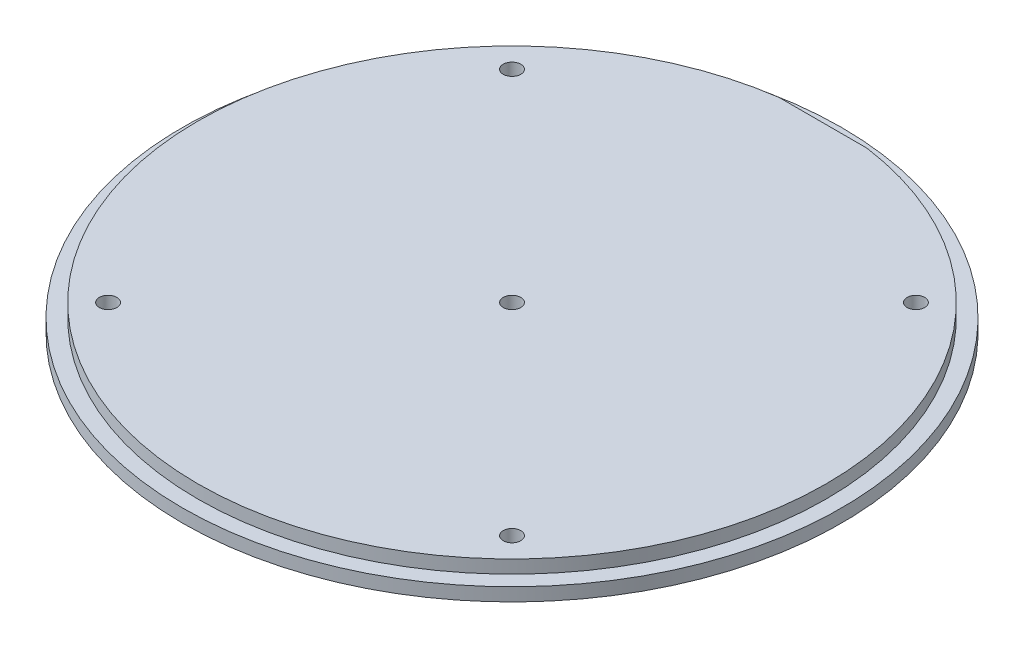
ISO-10303-21;
HEADER;
FILE_DESCRIPTION(('STEP AP214'),'2;1');
FILE_NAME('part.step','',(''),(''),'','','');
FILE_SCHEMA(('AUTOMOTIVE_DESIGN { 1 0 10303 214 1 1 1 1 }'));
ENDSEC;
DATA;
#1=APPLICATION_CONTEXT('core data for automotive mechanical design processes');
#2=APPLICATION_PROTOCOL_DEFINITION('international standard','automotive_design',2000,#1);
#3=PRODUCT_CONTEXT('',#1,'mechanical');
#4=PRODUCT('Part','Part','',(#3));
#5=PRODUCT_RELATED_PRODUCT_CATEGORY('part','',(#4));
#6=PRODUCT_DEFINITION_FORMATION('','',#4);
#7=PRODUCT_DEFINITION_CONTEXT('part definition',#1,'design');
#8=PRODUCT_DEFINITION('design','',#6,#7);
#9=PRODUCT_DEFINITION_SHAPE('','',#8);
#10=(LENGTH_UNIT() NAMED_UNIT(*) SI_UNIT(.MILLI.,.METRE.));
#11=(NAMED_UNIT(*) PLANE_ANGLE_UNIT() SI_UNIT($,.RADIAN.));
#12=(NAMED_UNIT(*) SI_UNIT($,.STERADIAN.) SOLID_ANGLE_UNIT());
#13=UNCERTAINTY_MEASURE_WITH_UNIT(LENGTH_MEASURE(1.E-05),#10,'distance_accuracy_value','');
#14=(GEOMETRIC_REPRESENTATION_CONTEXT(3) GLOBAL_UNCERTAINTY_ASSIGNED_CONTEXT((#13)) GLOBAL_UNIT_ASSIGNED_CONTEXT((#10,
#11,#12)) REPRESENTATION_CONTEXT('',''));
#15=CARTESIAN_POINT('',(0.,0.,0.));
#16=DIRECTION('',(0.,0.,1.));
#17=DIRECTION('',(1.,0.,0.));
#18=AXIS2_PLACEMENT_3D('',#15,#16,#17);
#19=CARTESIAN_POINT('',(0.,3.,0.));
#20=DIRECTION('',(0.,-1.,0.));
#21=DIRECTION('',(0.,0.,-1.));
#22=AXIS2_PLACEMENT_3D('',#19,#20,#21);
#23=CYLINDRICAL_SURFACE('',#22,75.);
#24=CARTESIAN_POINT('',(0.,3.,0.));
#25=DIRECTION('',(0.,1.,0.));
#26=DIRECTION('',(0.,0.,1.));
#27=AXIS2_PLACEMENT_3D('',#24,#25,#26);
#28=CIRCLE('',#27,75.);
#29=CARTESIAN_POINT('',(0.,3.,75.));
#30=VERTEX_POINT('',#29);
#31=EDGE_CURVE('E80',#30,#30,#28,.T.);
#32=ORIENTED_EDGE('',*,*,#31,.F.);
#33=EDGE_LOOP('',(#32));
#34=FACE_BOUND('',#33,.T.);
#35=CARTESIAN_POINT('',(0.,0.,0.));
#36=DIRECTION('',(0.,1.,0.));
#37=DIRECTION('',(0.,0.,1.));
#38=AXIS2_PLACEMENT_3D('',#35,#36,#37);
#39=CIRCLE('',#38,75.);
#40=CARTESIAN_POINT('',(0.,0.,75.));
#41=VERTEX_POINT('',#40);
#42=EDGE_CURVE('E76',#41,#41,#39,.T.);
#43=ORIENTED_EDGE('',*,*,#42,.T.);
#44=EDGE_LOOP('',(#43));
#45=FACE_BOUND('',#44,.T.);
#46=ADVANCED_FACE('F35',(#34,#45),#23,.T.);
#47=CARTESIAN_POINT('',(0.,3.,0.));
#48=DIRECTION('',(0.,1.,0.));
#49=DIRECTION('',(0.,0.,1.));
#50=AXIS2_PLACEMENT_3D('',#47,#48,#49);
#51=PLANE('',#50);
#52=CARTESIAN_POINT('',(0.,3.,0.));
#53=DIRECTION('',(0.,1.,0.));
#54=DIRECTION('',(0.,0.,1.));
#55=AXIS2_PLACEMENT_3D('',#52,#53,#54);
#56=CIRCLE('',#55,71.5);
#57=CARTESIAN_POINT('',(-10.,3.,-70.7972457091376));
#58=VERTEX_POINT('',#57);
#59=CARTESIAN_POINT('',(10.,3.,-70.7972457091376));
#60=VERTEX_POINT('',#59);
#61=EDGE_CURVE('E72',#58,#60,#56,.T.);
#62=ORIENTED_EDGE('',*,*,#61,.F.);
#63=DIRECTION('',(-1.,0.,0.));
#64=VECTOR('',#63,1.);
#65=CARTESIAN_POINT('',(-10.,3.,-70.7972457091376));
#66=LINE('',#65,#64);
#67=EDGE_CURVE('E55',#60,#58,#66,.T.);
#68=ORIENTED_EDGE('',*,*,#67,.F.);
#69=EDGE_LOOP('',(#62,#68));
#70=FACE_BOUND('',#69,.T.);
#71=ORIENTED_EDGE('',*,*,#31,.T.);
#72=EDGE_LOOP('',(#71));
#73=FACE_BOUND('',#72,.T.);
#74=ADVANCED_FACE('F130',(#70,#73),#51,.T.);
#75=CARTESIAN_POINT('',(0.,0.,0.));
#76=DIRECTION('',(0.,1.,0.));
#77=DIRECTION('',(0.,0.,1.));
#78=AXIS2_PLACEMENT_3D('',#75,#76,#77);
#79=PLANE('',#78);
#80=CARTESIAN_POINT('',(0.,0.,0.));
#81=DIRECTION('',(0.,1.,0.));
#82=DIRECTION('',(0.,0.,1.));
#83=AXIS2_PLACEMENT_3D('',#80,#81,#82);
#84=CIRCLE('',#83,4.);
#85=CARTESIAN_POINT('',(0.,0.,4.));
#86=VERTEX_POINT('',#85);
#87=EDGE_CURVE('E11',#86,#86,#84,.T.);
#88=ORIENTED_EDGE('',*,*,#87,.T.);
#89=EDGE_LOOP('',(#88));
#90=FACE_BOUND('',#89,.T.);
#91=CARTESIAN_POINT('',(45.9619407771258,0.,-45.9619407771253));
#92=DIRECTION('',(0.,1.,0.));
#93=DIRECTION('',(0.,0.,1.));
#94=AXIS2_PLACEMENT_3D('',#91,#92,#93);
#95=CIRCLE('',#94,4.00000000000006);
#96=CARTESIAN_POINT('',(45.9619407771258,0.,-41.9619407771253));
#97=VERTEX_POINT('',#96);
#98=EDGE_CURVE('E111',#97,#97,#95,.T.);
#99=ORIENTED_EDGE('',*,*,#98,.T.);
#100=EDGE_LOOP('',(#99));
#101=FACE_BOUND('',#100,.T.);
#102=CARTESIAN_POINT('',(-45.9619407771258,0.,-45.9619407771253));
#103=DIRECTION('',(0.,1.,0.));
#104=DIRECTION('',(0.,0.,1.));
#105=AXIS2_PLACEMENT_3D('',#102,#103,#104);
#106=CIRCLE('',#105,4.00000000000006);
#107=CARTESIAN_POINT('',(-45.9619407771258,0.,-41.9619407771253));
#108=VERTEX_POINT('',#107);
#109=EDGE_CURVE('E105',#108,#108,#106,.T.);
#110=ORIENTED_EDGE('',*,*,#109,.T.);
#111=EDGE_LOOP('',(#110));
#112=FACE_BOUND('',#111,.T.);
#113=CARTESIAN_POINT('',(-45.9619407771255,0.,45.9619407771257));
#114=DIRECTION('',(0.,1.,0.));
#115=DIRECTION('',(0.,0.,1.));
#116=AXIS2_PLACEMENT_3D('',#113,#114,#115);
#117=CIRCLE('',#116,4.);
#118=CARTESIAN_POINT('',(-45.9619407771255,0.,49.9619407771257));
#119=VERTEX_POINT('',#118);
#120=EDGE_CURVE('E99',#119,#119,#117,.T.);
#121=ORIENTED_EDGE('',*,*,#120,.T.);
#122=EDGE_LOOP('',(#121));
#123=FACE_BOUND('',#122,.T.);
#124=CARTESIAN_POINT('',(45.9619407771258,0.,45.9619407771253));
#125=DIRECTION('',(0.,1.,0.));
#126=DIRECTION('',(0.,0.,1.));
#127=AXIS2_PLACEMENT_3D('',#124,#125,#126);
#128=CIRCLE('',#127,4.00000000000006);
#129=CARTESIAN_POINT('',(45.9619407771258,0.,49.9619407771254));
#130=VERTEX_POINT('',#129);
#131=EDGE_CURVE('E93',#130,#130,#128,.T.);
#132=ORIENTED_EDGE('',*,*,#131,.T.);
#133=EDGE_LOOP('',(#132));
#134=FACE_BOUND('',#133,.T.);
#135=ORIENTED_EDGE('',*,*,#42,.F.);
#136=EDGE_LOOP('',(#135));
#137=FACE_BOUND('',#136,.T.);
#138=ADVANCED_FACE('F136',(#90,#101,#112,#123,#134,#137),#79,.F.);
#139=CARTESIAN_POINT('',(0.,6.,0.));
#140=DIRECTION('',(0.,-1.,0.));
#141=DIRECTION('',(0.,0.,-1.));
#142=AXIS2_PLACEMENT_3D('',#139,#140,#141);
#143=CYLINDRICAL_SURFACE('',#142,71.5);
#144=CARTESIAN_POINT('',(0.,6.,0.));
#145=DIRECTION('',(0.,1.,0.));
#146=DIRECTION('',(0.,0.,1.));
#147=AXIS2_PLACEMENT_3D('',#144,#145,#146);
#148=CIRCLE('',#147,71.5);
#149=CARTESIAN_POINT('',(-10.,6.,-70.7972457091376));
#150=VERTEX_POINT('',#149);
#151=CARTESIAN_POINT('',(10.,6.,-70.7972457091376));
#152=VERTEX_POINT('',#151);
#153=EDGE_CURVE('E70',#150,#152,#148,.T.);
#154=ORIENTED_EDGE('',*,*,#153,.F.);
#155=DIRECTION('',(0.,1.,0.));
#156=VECTOR('',#155,1.);
#157=CARTESIAN_POINT('',(-10.,-17.0123427812269,-70.7972457091376));
#158=LINE('',#157,#156);
#159=EDGE_CURVE('E50',#58,#150,#158,.T.);
#160=ORIENTED_EDGE('',*,*,#159,.F.);
#161=ORIENTED_EDGE('',*,*,#61,.T.);
#162=DIRECTION('',(0.,1.,0.));
#163=VECTOR('',#162,1.);
#164=CARTESIAN_POINT('',(10.,-17.0123427812269,-70.7972457091376));
#165=LINE('',#164,#163);
#166=EDGE_CURVE('E62',#60,#152,#165,.T.);
#167=ORIENTED_EDGE('',*,*,#166,.T.);
#168=EDGE_LOOP('',(#154,#160,#161,#167));
#169=FACE_BOUND('',#168,.T.);
#170=ADVANCED_FACE('F69',(#169),#143,.T.);
#171=CARTESIAN_POINT('',(0.,6.,0.));
#172=DIRECTION('',(0.,1.,0.));
#173=DIRECTION('',(0.,0.,1.));
#174=AXIS2_PLACEMENT_3D('',#171,#172,#173);
#175=PLANE('',#174);
#176=DIRECTION('',(1.,0.,0.));
#177=VECTOR('',#176,1.);
#178=CARTESIAN_POINT('',(-10.,6.,-70.7972457091376));
#179=LINE('',#178,#177);
#180=EDGE_CURVE('E59',#150,#152,#179,.T.);
#181=ORIENTED_EDGE('',*,*,#180,.F.);
#182=ORIENTED_EDGE('',*,*,#153,.T.);
#183=EDGE_LOOP('',(#181,#182));
#184=FACE_BOUND('',#183,.T.);
#185=CARTESIAN_POINT('',(0.,6.,0.));
#186=DIRECTION('',(0.,-1.,0.));
#187=DIRECTION('',(0.,0.,-1.));
#188=AXIS2_PLACEMENT_3D('',#185,#186,#187);
#189=CIRCLE('',#188,2.00000000000001);
#190=CARTESIAN_POINT('',(0.,6.,-2.00000000000001));
#191=VERTEX_POINT('',#190);
#192=EDGE_CURVE('E174',#191,#191,#189,.T.);
#193=ORIENTED_EDGE('',*,*,#192,.T.);
#194=EDGE_LOOP('',(#193));
#195=FACE_BOUND('',#194,.T.);
#196=CARTESIAN_POINT('',(-45.9619407771255,6.,45.9619407771257));
#197=DIRECTION('',(0.,-1.,0.));
#198=DIRECTION('',(1.,0.,0.));
#199=AXIS2_PLACEMENT_3D('',#196,#197,#198);
#200=CIRCLE('',#199,2.00000000000001);
#201=CARTESIAN_POINT('',(-43.9619407771255,6.,45.9619407771257));
#202=VERTEX_POINT('',#201);
#203=EDGE_CURVE('E83',#202,#202,#200,.T.);
#204=ORIENTED_EDGE('',*,*,#203,.T.);
#205=EDGE_LOOP('',(#204));
#206=FACE_BOUND('',#205,.T.);
#207=CARTESIAN_POINT('',(-45.9619407771258,6.,-45.9619407771253));
#208=DIRECTION('',(0.,-1.,0.));
#209=DIRECTION('',(0.,0.,1.));
#210=AXIS2_PLACEMENT_3D('',#207,#208,#209);
#211=CIRCLE('',#210,2.00000000000001);
#212=CARTESIAN_POINT('',(-45.9619407771258,6.,-43.9619407771253));
#213=VERTEX_POINT('',#212);
#214=EDGE_CURVE('E173',#213,#213,#211,.T.);
#215=ORIENTED_EDGE('',*,*,#214,.T.);
#216=EDGE_LOOP('',(#215));
#217=FACE_BOUND('',#216,.T.);
#218=CARTESIAN_POINT('',(45.9619407771258,6.,-45.9619407771253));
#219=DIRECTION('',(0.,-1.,0.));
#220=DIRECTION('',(-1.,0.,0.));
#221=AXIS2_PLACEMENT_3D('',#218,#219,#220);
#222=CIRCLE('',#221,2.00000000000001);
#223=CARTESIAN_POINT('',(43.9619407771258,6.,-45.9619407771254));
#224=VERTEX_POINT('',#223);
#225=EDGE_CURVE('E171',#224,#224,#222,.T.);
#226=ORIENTED_EDGE('',*,*,#225,.T.);
#227=EDGE_LOOP('',(#226));
#228=FACE_BOUND('',#227,.T.);
#229=CARTESIAN_POINT('',(45.9619407771258,6.,45.9619407771253));
#230=DIRECTION('',(0.,-1.,0.));
#231=DIRECTION('',(0.,0.,-1.));
#232=AXIS2_PLACEMENT_3D('',#229,#230,#231);
#233=CIRCLE('',#232,2.00000000000001);
#234=CARTESIAN_POINT('',(45.9619407771258,6.,43.9619407771253));
#235=VERTEX_POINT('',#234);
#236=EDGE_CURVE('E77',#235,#235,#233,.T.);
#237=ORIENTED_EDGE('',*,*,#236,.T.);
#238=EDGE_LOOP('',(#237));
#239=FACE_BOUND('',#238,.T.);
#240=ADVANCED_FACE('F74',(#184,#195,#206,#217,#228,#239),#175,.T.);
#241=CARTESIAN_POINT('',(45.9619407771258,6.,45.9619407771253));
#242=DIRECTION('',(0.,-1.,0.));
#243=DIRECTION('',(0.,0.,-1.));
#244=AXIS2_PLACEMENT_3D('',#241,#242,#243);
#245=CYLINDRICAL_SURFACE('',#244,2.00000000000001);
#246=CARTESIAN_POINT('',(45.9619407771258,2.00000000000003,45.9619407771253));
#247=DIRECTION('',(0.,1.,0.));
#248=DIRECTION('',(0.,0.,1.));
#249=AXIS2_PLACEMENT_3D('',#246,#247,#248);
#250=CIRCLE('',#249,2.00000000000001);
#251=CARTESIAN_POINT('',(45.9619407771258,2.00000000000003,47.9619407771254));
#252=VERTEX_POINT('',#251);
#253=EDGE_CURVE('E88',#252,#252,#250,.F.);
#254=ORIENTED_EDGE('',*,*,#253,.T.);
#255=EDGE_LOOP('',(#254));
#256=FACE_BOUND('',#255,.T.);
#257=ORIENTED_EDGE('',*,*,#236,.F.);
#258=EDGE_LOOP('',(#257));
#259=FACE_BOUND('',#258,.T.);
#260=ADVANCED_FACE('F147',(#256,#259),#245,.F.);
#261=CARTESIAN_POINT('',(45.9619407771258,2.00000000000003,45.9619407771253));
#262=DIRECTION('',(0.,-1.,0.));
#263=DIRECTION('',(0.,0.,-1.));
#264=AXIS2_PLACEMENT_3D('',#261,#262,#263);
#265=CONICAL_SURFACE('',#264,2.00000000000001,0.785398163397453);
#266=ORIENTED_EDGE('',*,*,#131,.F.);
#267=EDGE_LOOP('',(#266));
#268=FACE_BOUND('',#267,.T.);
#269=ORIENTED_EDGE('',*,*,#253,.F.);
#270=EDGE_LOOP('',(#269));
#271=FACE_BOUND('',#270,.T.);
#272=ADVANCED_FACE('F143',(#268,#271),#265,.F.);
#273=CARTESIAN_POINT('',(45.9619407771258,6.,-45.9619407771253));
#274=DIRECTION('',(0.,-1.,0.));
#275=DIRECTION('',(0.,0.,-1.));
#276=AXIS2_PLACEMENT_3D('',#273,#274,#275);
#277=CYLINDRICAL_SURFACE('',#276,2.00000000000001);
#278=CARTESIAN_POINT('',(45.9619407771258,2.00000000000003,-45.9619407771253));
#279=DIRECTION('',(0.,1.,0.));
#280=DIRECTION('',(0.,0.,1.));
#281=AXIS2_PLACEMENT_3D('',#278,#279,#280);
#282=CIRCLE('',#281,2.00000000000001);
#283=CARTESIAN_POINT('',(45.9619407771258,2.00000000000003,-43.9619407771253));
#284=VERTEX_POINT('',#283);
#285=EDGE_CURVE('E108',#284,#284,#282,.F.);
#286=ORIENTED_EDGE('',*,*,#285,.T.);
#287=EDGE_LOOP('',(#286));
#288=FACE_BOUND('',#287,.T.);
#289=ORIENTED_EDGE('',*,*,#225,.F.);
#290=EDGE_LOOP('',(#289));
#291=FACE_BOUND('',#290,.T.);
#292=ADVANCED_FACE('F146',(#288,#291),#277,.F.);
#293=CARTESIAN_POINT('',(-45.9619407771258,6.,-45.9619407771253));
#294=DIRECTION('',(0.,-1.,0.));
#295=DIRECTION('',(0.,0.,-1.));
#296=AXIS2_PLACEMENT_3D('',#293,#294,#295);
#297=CYLINDRICAL_SURFACE('',#296,2.00000000000001);
#298=CARTESIAN_POINT('',(-45.9619407771258,2.00000000000003,-45.9619407771253));
#299=DIRECTION('',(0.,1.,0.));
#300=DIRECTION('',(0.,0.,1.));
#301=AXIS2_PLACEMENT_3D('',#298,#299,#300);
#302=CIRCLE('',#301,2.00000000000001);
#303=CARTESIAN_POINT('',(-45.9619407771258,2.00000000000003,-43.9619407771253));
#304=VERTEX_POINT('',#303);
#305=EDGE_CURVE('E102',#304,#304,#302,.F.);
#306=ORIENTED_EDGE('',*,*,#305,.T.);
#307=EDGE_LOOP('',(#306));
#308=FACE_BOUND('',#307,.T.);
#309=ORIENTED_EDGE('',*,*,#214,.F.);
#310=EDGE_LOOP('',(#309));
#311=FACE_BOUND('',#310,.T.);
#312=ADVANCED_FACE('F167',(#308,#311),#297,.F.);
#313=CARTESIAN_POINT('',(-45.9619407771255,6.,45.9619407771257));
#314=DIRECTION('',(0.,-1.,0.));
#315=DIRECTION('',(0.,0.,-1.));
#316=AXIS2_PLACEMENT_3D('',#313,#314,#315);
#317=CYLINDRICAL_SURFACE('',#316,2.00000000000001);
#318=CARTESIAN_POINT('',(-45.9619407771255,2.,45.9619407771257));
#319=DIRECTION('',(0.,1.,0.));
#320=DIRECTION('',(0.,0.,1.));
#321=AXIS2_PLACEMENT_3D('',#318,#319,#320);
#322=CIRCLE('',#321,2.00000000000001);
#323=CARTESIAN_POINT('',(-45.9619407771255,2.,47.9619407771257));
#324=VERTEX_POINT('',#323);
#325=EDGE_CURVE('E96',#324,#324,#322,.F.);
#326=ORIENTED_EDGE('',*,*,#325,.T.);
#327=EDGE_LOOP('',(#326));
#328=FACE_BOUND('',#327,.T.);
#329=ORIENTED_EDGE('',*,*,#203,.F.);
#330=EDGE_LOOP('',(#329));
#331=FACE_BOUND('',#330,.T.);
#332=ADVANCED_FACE('F153',(#328,#331),#317,.F.);
#333=CARTESIAN_POINT('',(-45.9619407771255,2.,45.9619407771257));
#334=DIRECTION('',(0.,-1.,0.));
#335=DIRECTION('',(0.,0.,-1.));
#336=AXIS2_PLACEMENT_3D('',#333,#334,#335);
#337=CONICAL_SURFACE('',#336,2.00000000000001,0.785398163397447);
#338=ORIENTED_EDGE('',*,*,#120,.F.);
#339=EDGE_LOOP('',(#338));
#340=FACE_BOUND('',#339,.T.);
#341=ORIENTED_EDGE('',*,*,#325,.F.);
#342=EDGE_LOOP('',(#341));
#343=FACE_BOUND('',#342,.T.);
#344=ADVANCED_FACE('F149',(#340,#343),#337,.F.);
#345=CARTESIAN_POINT('',(-45.9619407771258,2.00000000000003,-45.9619407771253));
#346=DIRECTION('',(0.,-1.,0.));
#347=DIRECTION('',(0.,0.,-1.));
#348=AXIS2_PLACEMENT_3D('',#345,#346,#347);
#349=CONICAL_SURFACE('',#348,2.00000000000001,0.785398163397453);
#350=ORIENTED_EDGE('',*,*,#109,.F.);
#351=EDGE_LOOP('',(#350));
#352=FACE_BOUND('',#351,.T.);
#353=ORIENTED_EDGE('',*,*,#305,.F.);
#354=EDGE_LOOP('',(#353));
#355=FACE_BOUND('',#354,.T.);
#356=ADVANCED_FACE('F152',(#352,#355),#349,.F.);
#357=CARTESIAN_POINT('',(45.9619407771258,2.00000000000003,-45.9619407771253));
#358=DIRECTION('',(0.,-1.,0.));
#359=DIRECTION('',(0.,0.,-1.));
#360=AXIS2_PLACEMENT_3D('',#357,#358,#359);
#361=CONICAL_SURFACE('',#360,2.00000000000001,0.785398163397453);
#362=ORIENTED_EDGE('',*,*,#98,.F.);
#363=EDGE_LOOP('',(#362));
#364=FACE_BOUND('',#363,.T.);
#365=ORIENTED_EDGE('',*,*,#285,.F.);
#366=EDGE_LOOP('',(#365));
#367=FACE_BOUND('',#366,.T.);
#368=ADVANCED_FACE('F126',(#364,#367),#361,.F.);
#369=CARTESIAN_POINT('',(0.,6.,0.));
#370=DIRECTION('',(0.,-1.,0.));
#371=DIRECTION('',(0.,0.,-1.));
#372=AXIS2_PLACEMENT_3D('',#369,#370,#371);
#373=CYLINDRICAL_SURFACE('',#372,2.00000000000001);
#374=CARTESIAN_POINT('',(0.,2.,0.));
#375=DIRECTION('',(0.,1.,0.));
#376=DIRECTION('',(0.,0.,1.));
#377=AXIS2_PLACEMENT_3D('',#374,#375,#376);
#378=CIRCLE('',#377,2.00000000000001);
#379=CARTESIAN_POINT('',(0.,2.,2.00000000000001));
#380=VERTEX_POINT('',#379);
#381=EDGE_CURVE('E43',#380,#380,#378,.F.);
#382=ORIENTED_EDGE('',*,*,#381,.T.);
#383=EDGE_LOOP('',(#382));
#384=FACE_BOUND('',#383,.T.);
#385=ORIENTED_EDGE('',*,*,#192,.F.);
#386=EDGE_LOOP('',(#385));
#387=FACE_BOUND('',#386,.T.);
#388=ADVANCED_FACE('F116',(#384,#387),#373,.F.);
#389=CARTESIAN_POINT('',(0.,2.,0.));
#390=DIRECTION('',(0.,-1.,0.));
#391=DIRECTION('',(0.,0.,-1.));
#392=AXIS2_PLACEMENT_3D('',#389,#390,#391);
#393=CONICAL_SURFACE('',#392,2.00000000000001,0.785398163397447);
#394=ORIENTED_EDGE('',*,*,#87,.F.);
#395=EDGE_LOOP('',(#394));
#396=FACE_BOUND('',#395,.T.);
#397=ORIENTED_EDGE('',*,*,#381,.F.);
#398=EDGE_LOOP('',(#397));
#399=FACE_BOUND('',#398,.T.);
#400=ADVANCED_FACE('F37',(#396,#399),#393,.F.);
#401=CARTESIAN_POINT('',(-10.,-17.0123427812269,-70.7972457091376));
#402=DIRECTION('',(0.,0.,1.));
#403=DIRECTION('',(1.,0.,0.));
#404=AXIS2_PLACEMENT_3D('',#401,#402,#403);
#405=PLANE('',#404);
#406=ORIENTED_EDGE('',*,*,#67,.T.);
#407=ORIENTED_EDGE('',*,*,#159,.T.);
#408=ORIENTED_EDGE('',*,*,#180,.T.);
#409=ORIENTED_EDGE('',*,*,#166,.F.);
#410=EDGE_LOOP('',(#406,#407,#408,#409));
#411=FACE_BOUND('',#410,.T.);
#412=ADVANCED_FACE('F61',(#411),#405,.F.);
#413=CLOSED_SHELL('',(#46,#74,#138,#170,#240,#260,#272,#292,#312,#332,#344,#356,#368,#388,#400,#412));
#414=MANIFOLD_SOLID_BREP('B2',#413);
#415=ADVANCED_BREP_SHAPE_REPRESENTATION('',(#18,#414),#14);
#416=SHAPE_DEFINITION_REPRESENTATION(#9,#415);
ENDSEC;
END-ISO-10303-21;
